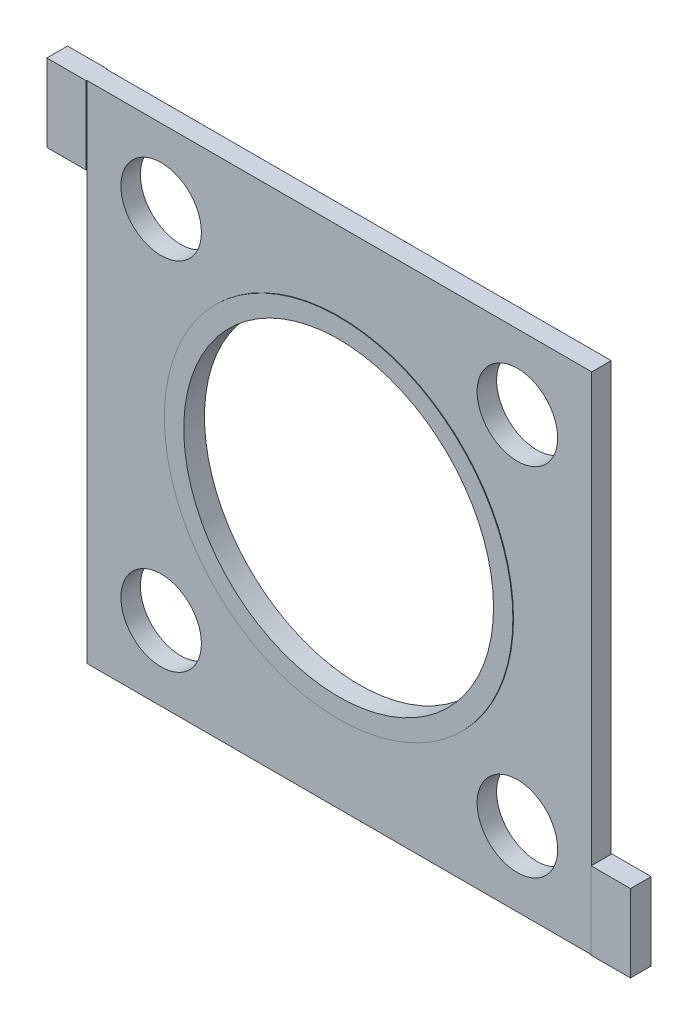
ISO-10303-21;
HEADER;
FILE_DESCRIPTION(('STEP AP214'),'2;1');
FILE_NAME('part.step','',(''),(''),'','','');
FILE_SCHEMA(('AUTOMOTIVE_DESIGN { 1 0 10303 214 1 1 1 1 }'));
ENDSEC;
DATA;
#1=APPLICATION_CONTEXT('core data for automotive mechanical design processes');
#2=APPLICATION_PROTOCOL_DEFINITION('international standard','automotive_design',2000,#1);
#3=PRODUCT_CONTEXT('',#1,'mechanical');
#4=PRODUCT('Part','Part','',(#3));
#5=PRODUCT_RELATED_PRODUCT_CATEGORY('part','',(#4));
#6=PRODUCT_DEFINITION_FORMATION('','',#4);
#7=PRODUCT_DEFINITION_CONTEXT('part definition',#1,'design');
#8=PRODUCT_DEFINITION('design','',#6,#7);
#9=PRODUCT_DEFINITION_SHAPE('','',#8);
#10=(LENGTH_UNIT() NAMED_UNIT(*) SI_UNIT(.MILLI.,.METRE.));
#11=(NAMED_UNIT(*) PLANE_ANGLE_UNIT() SI_UNIT($,.RADIAN.));
#12=(NAMED_UNIT(*) SI_UNIT($,.STERADIAN.) SOLID_ANGLE_UNIT());
#13=UNCERTAINTY_MEASURE_WITH_UNIT(LENGTH_MEASURE(1.E-05),#10,'distance_accuracy_value','');
#14=(GEOMETRIC_REPRESENTATION_CONTEXT(3) GLOBAL_UNCERTAINTY_ASSIGNED_CONTEXT((#13)) GLOBAL_UNIT_ASSIGNED_CONTEXT((#10,
#11,#12)) REPRESENTATION_CONTEXT('',''));
#15=CARTESIAN_POINT('',(0.,0.,0.));
#16=DIRECTION('',(0.,0.,1.));
#17=DIRECTION('',(1.,0.,0.));
#18=AXIS2_PLACEMENT_3D('',#15,#16,#17);
#19=CARTESIAN_POINT('',(0.,0.,0.79883));
#20=DIRECTION('',(0.,0.,1.));
#21=DIRECTION('',(1.,0.,0.));
#22=AXIS2_PLACEMENT_3D('',#19,#20,#21);
#23=PLANE('',#22);
#24=CARTESIAN_POINT('',(14.605,-14.605,0.79883));
#25=DIRECTION('',(0.,0.,-1.));
#26=DIRECTION('',(1.,0.,0.));
#27=AXIS2_PLACEMENT_3D('',#24,#25,#26);
#28=CIRCLE('',#27,3.30199999999999);
#29=CARTESIAN_POINT('',(17.907,-14.605,0.79883));
#30=VERTEX_POINT('',#29);
#31=EDGE_CURVE('E295',#30,#30,#28,.T.);
#32=ORIENTED_EDGE('',*,*,#31,.T.);
#33=EDGE_LOOP('',(#32));
#34=FACE_BOUND('',#33,.T.);
#35=CARTESIAN_POINT('',(-14.605,-14.605,0.79883));
#36=DIRECTION('',(0.,0.,-1.));
#37=DIRECTION('',(1.,0.,0.));
#38=AXIS2_PLACEMENT_3D('',#35,#36,#37);
#39=CIRCLE('',#38,3.302);
#40=CARTESIAN_POINT('',(-11.303,-14.605,0.79883));
#41=VERTEX_POINT('',#40);
#42=EDGE_CURVE('E285',#41,#41,#39,.T.);
#43=ORIENTED_EDGE('',*,*,#42,.T.);
#44=EDGE_LOOP('',(#43));
#45=FACE_BOUND('',#44,.T.);
#46=CARTESIAN_POINT('',(14.605,14.605,0.79883));
#47=DIRECTION('',(0.,0.,1.));
#48=DIRECTION('',(1.,0.,0.));
#49=AXIS2_PLACEMENT_3D('',#46,#47,#48);
#50=CIRCLE('',#49,3.30199999999999);
#51=CARTESIAN_POINT('',(17.907,14.605,0.79883));
#52=VERTEX_POINT('',#51);
#53=EDGE_CURVE('E282',#52,#52,#50,.T.);
#54=ORIENTED_EDGE('',*,*,#53,.F.);
#55=EDGE_LOOP('',(#54));
#56=FACE_BOUND('',#55,.T.);
#57=CARTESIAN_POINT('',(-14.605,14.605,0.79883));
#58=DIRECTION('',(0.,0.,1.));
#59=DIRECTION('',(1.,0.,0.));
#60=AXIS2_PLACEMENT_3D('',#57,#58,#59);
#61=CIRCLE('',#60,3.302);
#62=CARTESIAN_POINT('',(-11.303,14.605,0.79883));
#63=VERTEX_POINT('',#62);
#64=EDGE_CURVE('E279',#63,#63,#61,.T.);
#65=ORIENTED_EDGE('',*,*,#64,.F.);
#66=EDGE_LOOP('',(#65));
#67=FACE_BOUND('',#66,.T.);
#68=CARTESIAN_POINT('',(0.,0.,0.79883));
#69=DIRECTION('',(0.,0.,1.));
#70=DIRECTION('',(1.,0.,0.));
#71=AXIS2_PLACEMENT_3D('',#68,#69,#70);
#72=CIRCLE('',#71,14.2875);
#73=CARTESIAN_POINT('',(14.2875,0.,0.79883));
#74=VERTEX_POINT('',#73);
#75=EDGE_CURVE('E244',#74,#74,#72,.T.);
#76=ORIENTED_EDGE('',*,*,#75,.F.);
#77=EDGE_LOOP('',(#76));
#78=FACE_BOUND('',#77,.T.);
#79=DIRECTION('',(1.,0.,0.));
#80=VECTOR('',#79,1.);
#81=CARTESIAN_POINT('',(-20.701,-20.701,0.79883));
#82=LINE('',#81,#80);
#83=CARTESIAN_POINT('',(-20.701,-20.701,0.79883));
#84=VERTEX_POINT('',#83);
#85=CARTESIAN_POINT('',(20.701,-20.701,0.79883));
#86=VERTEX_POINT('',#85);
#87=EDGE_CURVE('E56',#84,#86,#82,.T.);
#88=ORIENTED_EDGE('',*,*,#87,.T.);
#89=DIRECTION('',(0.,-1.,0.));
#90=VECTOR('',#89,1.);
#91=CARTESIAN_POINT('',(20.701,-20.701,0.79883));
#92=LINE('',#91,#90);
#93=CARTESIAN_POINT('',(20.701,-14.351,0.79883));
#94=VERTEX_POINT('',#93);
#95=EDGE_CURVE('E206',#94,#86,#92,.T.);
#96=ORIENTED_EDGE('',*,*,#95,.F.);
#97=DIRECTION('',(0.,1.,0.));
#98=VECTOR('',#97,1.);
#99=CARTESIAN_POINT('',(20.701,20.701,0.79883));
#100=LINE('',#99,#98);
#101=CARTESIAN_POINT('',(20.701,20.701,0.79883));
#102=VERTEX_POINT('',#101);
#103=EDGE_CURVE('E263',#94,#102,#100,.T.);
#104=ORIENTED_EDGE('',*,*,#103,.T.);
#105=DIRECTION('',(-1.,0.,0.));
#106=VECTOR('',#105,1.);
#107=CARTESIAN_POINT('',(-20.701,20.701,0.79883));
#108=LINE('',#107,#106);
#109=CARTESIAN_POINT('',(-20.701,20.701,0.79883));
#110=VERTEX_POINT('',#109);
#111=EDGE_CURVE('E63',#102,#110,#108,.T.);
#112=ORIENTED_EDGE('',*,*,#111,.T.);
#113=DIRECTION('',(0.,1.,0.));
#114=VECTOR('',#113,1.);
#115=CARTESIAN_POINT('',(-20.701,20.701,0.79883));
#116=LINE('',#115,#114);
#117=CARTESIAN_POINT('',(-20.701,14.351,0.79883));
#118=VERTEX_POINT('',#117);
#119=EDGE_CURVE('E223',#118,#110,#116,.T.);
#120=ORIENTED_EDGE('',*,*,#119,.F.);
#121=DIRECTION('',(0.,-1.,0.));
#122=VECTOR('',#121,1.);
#123=CARTESIAN_POINT('',(-20.701,20.701,0.79883));
#124=LINE('',#123,#122);
#125=EDGE_CURVE('E257',#118,#84,#124,.T.);
#126=ORIENTED_EDGE('',*,*,#125,.T.);
#127=EDGE_LOOP('',(#88,#96,#104,#112,#120,#126));
#128=FACE_BOUND('',#127,.T.);
#129=ADVANCED_FACE('F39',(#34,#45,#56,#67,#78,#128),#23,.T.);
#130=CARTESIAN_POINT('',(-20.701,20.701,-0.79883));
#131=DIRECTION('',(-1.,0.,0.));
#132=DIRECTION('',(0.,0.,1.));
#133=AXIS2_PLACEMENT_3D('',#130,#131,#132);
#134=PLANE('',#133);
#135=DIRECTION('',(0.,0.,1.));
#136=VECTOR('',#135,1.);
#137=CARTESIAN_POINT('',(-20.701,14.351,-0.79883));
#138=LINE('',#137,#136);
#139=CARTESIAN_POINT('',(-20.701,14.351,-0.79883));
#140=VERTEX_POINT('',#139);
#141=EDGE_CURVE('E254',#140,#118,#138,.T.);
#142=ORIENTED_EDGE('',*,*,#141,.F.);
#143=DIRECTION('',(0.,-1.,0.));
#144=VECTOR('',#143,1.);
#145=CARTESIAN_POINT('',(-20.701,20.701,-0.79883));
#146=LINE('',#145,#144);
#147=CARTESIAN_POINT('',(-20.701,-20.701,-0.79883));
#148=VERTEX_POINT('',#147);
#149=EDGE_CURVE('E266',#140,#148,#146,.T.);
#150=ORIENTED_EDGE('',*,*,#149,.T.);
#151=DIRECTION('',(0.,0.,1.));
#152=VECTOR('',#151,1.);
#153=CARTESIAN_POINT('',(-20.701,-20.701,-0.79883));
#154=LINE('',#153,#152);
#155=EDGE_CURVE('E48',#148,#84,#154,.T.);
#156=ORIENTED_EDGE('',*,*,#155,.T.);
#157=ORIENTED_EDGE('',*,*,#125,.F.);
#158=EDGE_LOOP('',(#142,#150,#156,#157));
#159=FACE_BOUND('',#158,.T.);
#160=ADVANCED_FACE('F41',(#159),#134,.T.);
#161=CARTESIAN_POINT('',(-20.701,20.701,-0.79883));
#162=DIRECTION('',(0.,1.,0.));
#163=DIRECTION('',(0.,0.,1.));
#164=AXIS2_PLACEMENT_3D('',#161,#162,#163);
#165=PLANE('',#164);
#166=DIRECTION('',(-1.,0.,0.));
#167=VECTOR('',#166,1.);
#168=CARTESIAN_POINT('',(-20.701,20.701,-0.79883));
#169=LINE('',#168,#167);
#170=CARTESIAN_POINT('',(20.701,20.701,-0.79883));
#171=VERTEX_POINT('',#170);
#172=CARTESIAN_POINT('',(-20.701,20.701,-0.79883));
#173=VERTEX_POINT('',#172);
#174=EDGE_CURVE('E272',#171,#173,#169,.T.);
#175=ORIENTED_EDGE('',*,*,#174,.T.);
#176=DIRECTION('',(0.,0.,1.));
#177=VECTOR('',#176,1.);
#178=CARTESIAN_POINT('',(-20.701,20.701,-0.84963));
#179=LINE('',#178,#177);
#180=CARTESIAN_POINT('',(-20.701,20.701,-0.84963));
#181=VERTEX_POINT('',#180);
#182=EDGE_CURVE('E197',#181,#173,#179,.T.);
#183=ORIENTED_EDGE('',*,*,#182,.F.);
#184=DIRECTION('',(-1.,0.,0.));
#185=VECTOR('',#184,1.);
#186=CARTESIAN_POINT('',(-23.92934,20.701,-0.84963));
#187=LINE('',#186,#185);
#188=CARTESIAN_POINT('',(-23.92934,20.701,-0.84963));
#189=VERTEX_POINT('',#188);
#190=EDGE_CURVE('E184',#181,#189,#187,.T.);
#191=ORIENTED_EDGE('',*,*,#190,.T.);
#192=DIRECTION('',(0.,0.,1.));
#193=VECTOR('',#192,1.);
#194=CARTESIAN_POINT('',(-23.92934,20.701,-0.79883));
#195=LINE('',#194,#193);
#196=CARTESIAN_POINT('',(-23.92934,20.701,0.84963));
#197=VERTEX_POINT('',#196);
#198=EDGE_CURVE('E252',#189,#197,#195,.T.);
#199=ORIENTED_EDGE('',*,*,#198,.T.);
#200=DIRECTION('',(-1.,0.,0.));
#201=VECTOR('',#200,1.);
#202=CARTESIAN_POINT('',(-23.92934,20.701,0.84963));
#203=LINE('',#202,#201);
#204=CARTESIAN_POINT('',(-20.701,20.701,0.84963));
#205=VERTEX_POINT('',#204);
#206=EDGE_CURVE('E231',#205,#197,#203,.T.);
#207=ORIENTED_EDGE('',*,*,#206,.F.);
#208=DIRECTION('',(0.,0.,-1.));
#209=VECTOR('',#208,1.);
#210=CARTESIAN_POINT('',(-20.701,20.701,0.84963));
#211=LINE('',#210,#209);
#212=EDGE_CURVE('E234',#205,#110,#211,.T.);
#213=ORIENTED_EDGE('',*,*,#212,.T.);
#214=ORIENTED_EDGE('',*,*,#111,.F.);
#215=DIRECTION('',(0.,0.,1.));
#216=VECTOR('',#215,1.);
#217=CARTESIAN_POINT('',(20.701,20.701,-0.79883));
#218=LINE('',#217,#216);
#219=EDGE_CURVE('E11',#171,#102,#218,.T.);
#220=ORIENTED_EDGE('',*,*,#219,.F.);
#221=EDGE_LOOP('',(#175,#183,#191,#199,#207,#213,#214,#220));
#222=FACE_BOUND('',#221,.T.);
#223=ADVANCED_FACE('F348',(#222),#165,.T.);
#224=CARTESIAN_POINT('',(20.701,20.701,-0.79883));
#225=DIRECTION('',(1.,0.,0.));
#226=DIRECTION('',(0.,1.,0.));
#227=AXIS2_PLACEMENT_3D('',#224,#225,#226);
#228=PLANE('',#227);
#229=DIRECTION('',(0.,0.,1.));
#230=VECTOR('',#229,1.);
#231=CARTESIAN_POINT('',(20.701,-14.351,-0.79883));
#232=LINE('',#231,#230);
#233=CARTESIAN_POINT('',(20.701,-14.351,-0.79883));
#234=VERTEX_POINT('',#233);
#235=EDGE_CURVE('E249',#234,#94,#232,.T.);
#236=ORIENTED_EDGE('',*,*,#235,.F.);
#237=DIRECTION('',(0.,1.,0.));
#238=VECTOR('',#237,1.);
#239=CARTESIAN_POINT('',(20.701,20.701,-0.79883));
#240=LINE('',#239,#238);
#241=EDGE_CURVE('E270',#234,#171,#240,.T.);
#242=ORIENTED_EDGE('',*,*,#241,.T.);
#243=ORIENTED_EDGE('',*,*,#219,.T.);
#244=ORIENTED_EDGE('',*,*,#103,.F.);
#245=EDGE_LOOP('',(#236,#242,#243,#244));
#246=FACE_BOUND('',#245,.T.);
#247=ADVANCED_FACE('F351',(#246),#228,.T.);
#248=CARTESIAN_POINT('',(-20.701,-20.701,-0.79883));
#249=DIRECTION('',(0.,-1.,0.));
#250=DIRECTION('',(0.,0.,-1.));
#251=AXIS2_PLACEMENT_3D('',#248,#249,#250);
#252=PLANE('',#251);
#253=DIRECTION('',(1.,0.,0.));
#254=VECTOR('',#253,1.);
#255=CARTESIAN_POINT('',(-20.701,-20.701,-0.79883));
#256=LINE('',#255,#254);
#257=CARTESIAN_POINT('',(20.701,-20.701,-0.79883));
#258=VERTEX_POINT('',#257);
#259=EDGE_CURVE('E268',#148,#258,#256,.T.);
#260=ORIENTED_EDGE('',*,*,#259,.T.);
#261=DIRECTION('',(0.,0.,1.));
#262=VECTOR('',#261,1.);
#263=CARTESIAN_POINT('',(20.701,-20.701,-0.84963));
#264=LINE('',#263,#262);
#265=CARTESIAN_POINT('',(20.701,-20.701,-0.84963));
#266=VERTEX_POINT('',#265);
#267=EDGE_CURVE('E167',#266,#258,#264,.T.);
#268=ORIENTED_EDGE('',*,*,#267,.F.);
#269=DIRECTION('',(1.,0.,0.));
#270=VECTOR('',#269,1.);
#271=CARTESIAN_POINT('',(23.92934,-20.701,-0.84963));
#272=LINE('',#271,#270);
#273=CARTESIAN_POINT('',(23.92934,-20.701,-0.84963));
#274=VERTEX_POINT('',#273);
#275=EDGE_CURVE('E159',#266,#274,#272,.T.);
#276=ORIENTED_EDGE('',*,*,#275,.T.);
#277=DIRECTION('',(0.,0.,1.));
#278=VECTOR('',#277,1.);
#279=CARTESIAN_POINT('',(23.92934,-20.701,-0.79883));
#280=LINE('',#279,#278);
#281=CARTESIAN_POINT('',(23.92934,-20.701,0.84963));
#282=VERTEX_POINT('',#281);
#283=EDGE_CURVE('E141',#274,#282,#280,.T.);
#284=ORIENTED_EDGE('',*,*,#283,.T.);
#285=DIRECTION('',(1.,0.,0.));
#286=VECTOR('',#285,1.);
#287=CARTESIAN_POINT('',(23.92934,-20.701,0.84963));
#288=LINE('',#287,#286);
#289=CARTESIAN_POINT('',(20.701,-20.701,0.84963));
#290=VERTEX_POINT('',#289);
#291=EDGE_CURVE('E214',#290,#282,#288,.T.);
#292=ORIENTED_EDGE('',*,*,#291,.F.);
#293=DIRECTION('',(0.,0.,-1.));
#294=VECTOR('',#293,1.);
#295=CARTESIAN_POINT('',(20.701,-20.701,0.84963));
#296=LINE('',#295,#294);
#297=EDGE_CURVE('E216',#290,#86,#296,.T.);
#298=ORIENTED_EDGE('',*,*,#297,.T.);
#299=ORIENTED_EDGE('',*,*,#87,.F.);
#300=ORIENTED_EDGE('',*,*,#155,.F.);
#301=EDGE_LOOP('',(#260,#268,#276,#284,#292,#298,#299,#300));
#302=FACE_BOUND('',#301,.T.);
#303=ADVANCED_FACE('F166',(#302),#252,.T.);
#304=CARTESIAN_POINT('',(0.,0.,-0.79883));
#305=DIRECTION('',(0.,0.,1.));
#306=DIRECTION('',(1.,0.,0.));
#307=AXIS2_PLACEMENT_3D('',#304,#305,#306);
#308=PLANE('',#307);
#309=CARTESIAN_POINT('',(14.605,-14.605,-0.79883));
#310=DIRECTION('',(0.,0.,1.));
#311=DIRECTION('',(1.,0.,0.));
#312=AXIS2_PLACEMENT_3D('',#309,#310,#311);
#313=CIRCLE('',#312,3.30199999999999);
#314=CARTESIAN_POINT('',(17.907,-14.605,-0.79883));
#315=VERTEX_POINT('',#314);
#316=EDGE_CURVE('E43',#315,#315,#313,.F.);
#317=ORIENTED_EDGE('',*,*,#316,.F.);
#318=EDGE_LOOP('',(#317));
#319=FACE_BOUND('',#318,.T.);
#320=CARTESIAN_POINT('',(-14.605,-14.605,-0.79883));
#321=DIRECTION('',(0.,0.,1.));
#322=DIRECTION('',(1.,0.,0.));
#323=AXIS2_PLACEMENT_3D('',#320,#321,#322);
#324=CIRCLE('',#323,3.302);
#325=CARTESIAN_POINT('',(-11.303,-14.605,-0.79883));
#326=VERTEX_POINT('',#325);
#327=EDGE_CURVE('E283',#326,#326,#324,.F.);
#328=ORIENTED_EDGE('',*,*,#327,.F.);
#329=EDGE_LOOP('',(#328));
#330=FACE_BOUND('',#329,.T.);
#331=CARTESIAN_POINT('',(14.605,14.605,-0.79883));
#332=DIRECTION('',(0.,0.,1.));
#333=DIRECTION('',(1.,0.,0.));
#334=AXIS2_PLACEMENT_3D('',#331,#332,#333);
#335=CIRCLE('',#334,3.30199999999999);
#336=CARTESIAN_POINT('',(17.907,14.605,-0.79883));
#337=VERTEX_POINT('',#336);
#338=EDGE_CURVE('E280',#337,#337,#335,.T.);
#339=ORIENTED_EDGE('',*,*,#338,.T.);
#340=EDGE_LOOP('',(#339));
#341=FACE_BOUND('',#340,.T.);
#342=CARTESIAN_POINT('',(-14.605,14.605,-0.79883));
#343=DIRECTION('',(0.,0.,1.));
#344=DIRECTION('',(1.,0.,0.));
#345=AXIS2_PLACEMENT_3D('',#342,#343,#344);
#346=CIRCLE('',#345,3.302);
#347=CARTESIAN_POINT('',(-11.303,14.605,-0.79883));
#348=VERTEX_POINT('',#347);
#349=EDGE_CURVE('E177',#348,#348,#346,.T.);
#350=ORIENTED_EDGE('',*,*,#349,.T.);
#351=EDGE_LOOP('',(#350));
#352=FACE_BOUND('',#351,.T.);
#353=CARTESIAN_POINT('',(0.,0.,-0.79883));
#354=DIRECTION('',(0.,0.,1.));
#355=DIRECTION('',(1.,0.,0.));
#356=AXIS2_PLACEMENT_3D('',#353,#354,#355);
#357=CIRCLE('',#356,14.2875);
#358=CARTESIAN_POINT('',(14.2875,0.,-0.79883));
#359=VERTEX_POINT('',#358);
#360=EDGE_CURVE('E202',#359,#359,#357,.T.);
#361=ORIENTED_EDGE('',*,*,#360,.T.);
#362=EDGE_LOOP('',(#361));
#363=FACE_BOUND('',#362,.T.);
#364=ORIENTED_EDGE('',*,*,#241,.F.);
#365=DIRECTION('',(0.,-1.,0.));
#366=VECTOR('',#365,1.);
#367=CARTESIAN_POINT('',(20.701,-20.701,-0.79883));
#368=LINE('',#367,#366);
#369=EDGE_CURVE('E163',#234,#258,#368,.T.);
#370=ORIENTED_EDGE('',*,*,#369,.T.);
#371=ORIENTED_EDGE('',*,*,#259,.F.);
#372=ORIENTED_EDGE('',*,*,#149,.F.);
#373=DIRECTION('',(0.,1.,0.));
#374=VECTOR('',#373,1.);
#375=CARTESIAN_POINT('',(-20.701,20.701,-0.79883));
#376=LINE('',#375,#374);
#377=EDGE_CURVE('E180',#140,#173,#376,.T.);
#378=ORIENTED_EDGE('',*,*,#377,.T.);
#379=ORIENTED_EDGE('',*,*,#174,.F.);
#380=EDGE_LOOP('',(#364,#370,#371,#372,#378,#379));
#381=FACE_BOUND('',#380,.T.);
#382=ADVANCED_FACE('F340',(#319,#330,#341,#352,#363,#381),#308,.F.);
#383=CARTESIAN_POINT('',(-20.701,14.351,-0.79883));
#384=DIRECTION('',(0.,-1.,0.));
#385=DIRECTION('',(0.,0.,-1.));
#386=AXIS2_PLACEMENT_3D('',#383,#384,#385);
#387=PLANE('',#386);
#388=ORIENTED_EDGE('',*,*,#141,.T.);
#389=DIRECTION('',(0.,0.,-1.));
#390=VECTOR('',#389,1.);
#391=CARTESIAN_POINT('',(-20.701,14.351,0.84963));
#392=LINE('',#391,#390);
#393=CARTESIAN_POINT('',(-20.701,14.351,0.84963));
#394=VERTEX_POINT('',#393);
#395=EDGE_CURVE('E238',#394,#118,#392,.T.);
#396=ORIENTED_EDGE('',*,*,#395,.F.);
#397=DIRECTION('',(1.,0.,0.));
#398=VECTOR('',#397,1.);
#399=CARTESIAN_POINT('',(-23.92934,14.351,0.84963));
#400=LINE('',#399,#398);
#401=CARTESIAN_POINT('',(-23.92934,14.351,0.84963));
#402=VERTEX_POINT('',#401);
#403=EDGE_CURVE('E227',#402,#394,#400,.T.);
#404=ORIENTED_EDGE('',*,*,#403,.F.);
#405=DIRECTION('',(0.,0.,1.));
#406=VECTOR('',#405,1.);
#407=CARTESIAN_POINT('',(-23.92934,14.351,-0.79883));
#408=LINE('',#407,#406);
#409=CARTESIAN_POINT('',(-23.92934,14.351,-0.84963));
#410=VERTEX_POINT('',#409);
#411=EDGE_CURVE('E258',#410,#402,#408,.T.);
#412=ORIENTED_EDGE('',*,*,#411,.F.);
#413=DIRECTION('',(1.,0.,0.));
#414=VECTOR('',#413,1.);
#415=CARTESIAN_POINT('',(-23.92934,14.351,-0.84963));
#416=LINE('',#415,#414);
#417=CARTESIAN_POINT('',(-20.701,14.351,-0.84963));
#418=VERTEX_POINT('',#417);
#419=EDGE_CURVE('E190',#410,#418,#416,.T.);
#420=ORIENTED_EDGE('',*,*,#419,.T.);
#421=DIRECTION('',(0.,0.,1.));
#422=VECTOR('',#421,1.);
#423=CARTESIAN_POINT('',(-20.701,14.351,-0.84963));
#424=LINE('',#423,#422);
#425=EDGE_CURVE('E193',#418,#140,#424,.T.);
#426=ORIENTED_EDGE('',*,*,#425,.T.);
#427=EDGE_LOOP('',(#388,#396,#404,#412,#420,#426));
#428=FACE_BOUND('',#427,.T.);
#429=ADVANCED_FACE('F337',(#428),#387,.T.);
#430=CARTESIAN_POINT('',(-23.92934,20.701,-0.79883));
#431=DIRECTION('',(-1.,0.,0.));
#432=DIRECTION('',(0.,0.,1.));
#433=AXIS2_PLACEMENT_3D('',#430,#431,#432);
#434=PLANE('',#433);
#435=ORIENTED_EDGE('',*,*,#411,.T.);
#436=DIRECTION('',(0.,-1.,0.));
#437=VECTOR('',#436,1.);
#438=CARTESIAN_POINT('',(-23.92934,20.701,0.84963));
#439=LINE('',#438,#437);
#440=EDGE_CURVE('E224',#197,#402,#439,.T.);
#441=ORIENTED_EDGE('',*,*,#440,.F.);
#442=ORIENTED_EDGE('',*,*,#198,.F.);
#443=DIRECTION('',(0.,-1.,0.));
#444=VECTOR('',#443,1.);
#445=CARTESIAN_POINT('',(-23.92934,20.701,-0.84963));
#446=LINE('',#445,#444);
#447=EDGE_CURVE('E181',#189,#410,#446,.T.);
#448=ORIENTED_EDGE('',*,*,#447,.T.);
#449=EDGE_LOOP('',(#435,#441,#442,#448));
#450=FACE_BOUND('',#449,.T.);
#451=ADVANCED_FACE('F333',(#450),#434,.T.);
#452=CARTESIAN_POINT('',(20.701,-14.351,-0.79883));
#453=DIRECTION('',(0.,1.,0.));
#454=DIRECTION('',(0.,0.,1.));
#455=AXIS2_PLACEMENT_3D('',#452,#453,#454);
#456=PLANE('',#455);
#457=ORIENTED_EDGE('',*,*,#235,.T.);
#458=DIRECTION('',(0.,0.,-1.));
#459=VECTOR('',#458,1.);
#460=CARTESIAN_POINT('',(20.701,-14.351,0.84963));
#461=LINE('',#460,#459);
#462=CARTESIAN_POINT('',(20.701,-14.351,0.84963));
#463=VERTEX_POINT('',#462);
#464=EDGE_CURVE('E220',#463,#94,#461,.T.);
#465=ORIENTED_EDGE('',*,*,#464,.F.);
#466=DIRECTION('',(-1.,0.,0.));
#467=VECTOR('',#466,1.);
#468=CARTESIAN_POINT('',(23.92934,-14.351,0.84963));
#469=LINE('',#468,#467);
#470=CARTESIAN_POINT('',(23.92934,-14.351,0.84963));
#471=VERTEX_POINT('',#470);
#472=EDGE_CURVE('E210',#471,#463,#469,.T.);
#473=ORIENTED_EDGE('',*,*,#472,.F.);
#474=DIRECTION('',(0.,0.,1.));
#475=VECTOR('',#474,1.);
#476=CARTESIAN_POINT('',(23.92934,-14.351,-0.79883));
#477=LINE('',#476,#475);
#478=CARTESIAN_POINT('',(23.92934,-14.351,-0.84963));
#479=VERTEX_POINT('',#478);
#480=EDGE_CURVE('E152',#479,#471,#477,.T.);
#481=ORIENTED_EDGE('',*,*,#480,.F.);
#482=DIRECTION('',(-1.,0.,0.));
#483=VECTOR('',#482,1.);
#484=CARTESIAN_POINT('',(23.92934,-14.351,-0.84963));
#485=LINE('',#484,#483);
#486=CARTESIAN_POINT('',(20.701,-14.351,-0.84963));
#487=VERTEX_POINT('',#486);
#488=EDGE_CURVE('E162',#479,#487,#485,.T.);
#489=ORIENTED_EDGE('',*,*,#488,.T.);
#490=DIRECTION('',(0.,0.,1.));
#491=VECTOR('',#490,1.);
#492=CARTESIAN_POINT('',(20.701,-14.351,-0.84963));
#493=LINE('',#492,#491);
#494=EDGE_CURVE('E174',#487,#234,#493,.T.);
#495=ORIENTED_EDGE('',*,*,#494,.T.);
#496=EDGE_LOOP('',(#457,#465,#473,#481,#489,#495));
#497=FACE_BOUND('',#496,.T.);
#498=ADVANCED_FACE('F330',(#497),#456,.T.);
#499=CARTESIAN_POINT('',(23.92934,-20.701,-0.79883));
#500=DIRECTION('',(1.,0.,0.));
#501=DIRECTION('',(0.,0.,-1.));
#502=AXIS2_PLACEMENT_3D('',#499,#500,#501);
#503=PLANE('',#502);
#504=ORIENTED_EDGE('',*,*,#480,.T.);
#505=DIRECTION('',(0.,1.,0.));
#506=VECTOR('',#505,1.);
#507=CARTESIAN_POINT('',(23.92934,-20.701,0.84963));
#508=LINE('',#507,#506);
#509=EDGE_CURVE('E147',#282,#471,#508,.T.);
#510=ORIENTED_EDGE('',*,*,#509,.F.);
#511=ORIENTED_EDGE('',*,*,#283,.F.);
#512=DIRECTION('',(0.,1.,0.));
#513=VECTOR('',#512,1.);
#514=CARTESIAN_POINT('',(23.92934,-20.701,-0.84963));
#515=LINE('',#514,#513);
#516=EDGE_CURVE('E144',#274,#479,#515,.T.);
#517=ORIENTED_EDGE('',*,*,#516,.T.);
#518=EDGE_LOOP('',(#504,#510,#511,#517));
#519=FACE_BOUND('',#518,.T.);
#520=ADVANCED_FACE('F143',(#519),#503,.T.);
#521=CARTESIAN_POINT('',(0.,0.,-0.79883));
#522=DIRECTION('',(0.,0.,1.));
#523=DIRECTION('',(1.,0.,0.));
#524=AXIS2_PLACEMENT_3D('',#521,#522,#523);
#525=CYLINDRICAL_SURFACE('',#524,12.7);
#526=CARTESIAN_POINT('',(0.,0.,0.84963));
#527=DIRECTION('',(0.,0.,1.));
#528=DIRECTION('',(1.,0.,0.));
#529=AXIS2_PLACEMENT_3D('',#526,#527,#528);
#530=CIRCLE('',#529,12.7);
#531=CARTESIAN_POINT('',(12.7,0.,0.84963));
#532=VERTEX_POINT('',#531);
#533=EDGE_CURVE('E241',#532,#532,#530,.T.);
#534=ORIENTED_EDGE('',*,*,#533,.T.);
#535=EDGE_LOOP('',(#534));
#536=FACE_BOUND('',#535,.T.);
#537=CARTESIAN_POINT('',(0.,0.,-0.84963));
#538=DIRECTION('',(0.,0.,1.));
#539=DIRECTION('',(1.,0.,0.));
#540=AXIS2_PLACEMENT_3D('',#537,#538,#539);
#541=CIRCLE('',#540,12.7);
#542=CARTESIAN_POINT('',(12.7,0.,-0.84963));
#543=VERTEX_POINT('',#542);
#544=EDGE_CURVE('E199',#543,#543,#541,.T.);
#545=ORIENTED_EDGE('',*,*,#544,.F.);
#546=EDGE_LOOP('',(#545));
#547=FACE_BOUND('',#546,.T.);
#548=ADVANCED_FACE('F322',(#536,#547),#525,.F.);
#549=CARTESIAN_POINT('',(0.,0.,0.84963));
#550=DIRECTION('',(0.,0.,1.));
#551=DIRECTION('',(1.,0.,0.));
#552=AXIS2_PLACEMENT_3D('',#549,#550,#551);
#553=PLANE('',#552);
#554=CARTESIAN_POINT('',(0.,0.,0.84963));
#555=DIRECTION('',(0.,0.,1.));
#556=DIRECTION('',(1.,0.,0.));
#557=AXIS2_PLACEMENT_3D('',#554,#555,#556);
#558=CIRCLE('',#557,14.2875);
#559=CARTESIAN_POINT('',(14.2875,0.,0.84963));
#560=VERTEX_POINT('',#559);
#561=EDGE_CURVE('E153',#560,#560,#558,.T.);
#562=ORIENTED_EDGE('',*,*,#561,.T.);
#563=EDGE_LOOP('',(#562));
#564=FACE_BOUND('',#563,.T.);
#565=ORIENTED_EDGE('',*,*,#533,.F.);
#566=EDGE_LOOP('',(#565));
#567=FACE_BOUND('',#566,.T.);
#568=ADVANCED_FACE('F312',(#564,#567),#553,.T.);
#569=CARTESIAN_POINT('',(0.,0.,0.84963));
#570=DIRECTION('',(0.,0.,-1.));
#571=DIRECTION('',(-1.,0.,0.));
#572=AXIS2_PLACEMENT_3D('',#569,#570,#571);
#573=CYLINDRICAL_SURFACE('',#572,14.2875);
#574=ORIENTED_EDGE('',*,*,#561,.F.);
#575=EDGE_LOOP('',(#574));
#576=FACE_BOUND('',#575,.T.);
#577=ORIENTED_EDGE('',*,*,#75,.T.);
#578=EDGE_LOOP('',(#577));
#579=FACE_BOUND('',#578,.T.);
#580=ADVANCED_FACE('F309',(#576,#579),#573,.T.);
#581=CARTESIAN_POINT('',(-20.701,20.701,0.84963));
#582=DIRECTION('',(-1.,0.,0.));
#583=DIRECTION('',(0.,0.,1.));
#584=AXIS2_PLACEMENT_3D('',#581,#582,#583);
#585=PLANE('',#584);
#586=ORIENTED_EDGE('',*,*,#119,.T.);
#587=ORIENTED_EDGE('',*,*,#212,.F.);
#588=DIRECTION('',(0.,1.,0.));
#589=VECTOR('',#588,1.);
#590=CARTESIAN_POINT('',(-20.701,20.701,0.84963));
#591=LINE('',#590,#589);
#592=EDGE_CURVE('E229',#394,#205,#591,.T.);
#593=ORIENTED_EDGE('',*,*,#592,.F.);
#594=ORIENTED_EDGE('',*,*,#395,.T.);
#595=EDGE_LOOP('',(#586,#587,#593,#594));
#596=FACE_BOUND('',#595,.T.);
#597=ADVANCED_FACE('F311',(#596),#585,.F.);
#598=CARTESIAN_POINT('',(0.,0.,0.84963));
#599=DIRECTION('',(0.,0.,1.));
#600=DIRECTION('',(1.,0.,0.));
#601=AXIS2_PLACEMENT_3D('',#598,#599,#600);
#602=PLANE('',#601);
#603=ORIENTED_EDGE('',*,*,#440,.T.);
#604=ORIENTED_EDGE('',*,*,#403,.T.);
#605=ORIENTED_EDGE('',*,*,#592,.T.);
#606=ORIENTED_EDGE('',*,*,#206,.T.);
#607=EDGE_LOOP('',(#603,#604,#605,#606));
#608=FACE_BOUND('',#607,.T.);
#609=ADVANCED_FACE('F319',(#608),#602,.T.);
#610=CARTESIAN_POINT('',(20.701,-20.701,0.84963));
#611=DIRECTION('',(1.,0.,0.));
#612=DIRECTION('',(0.,0.,-1.));
#613=AXIS2_PLACEMENT_3D('',#610,#611,#612);
#614=PLANE('',#613);
#615=ORIENTED_EDGE('',*,*,#95,.T.);
#616=ORIENTED_EDGE('',*,*,#297,.F.);
#617=DIRECTION('',(0.,-1.,0.));
#618=VECTOR('',#617,1.);
#619=CARTESIAN_POINT('',(20.701,-20.701,0.84963));
#620=LINE('',#619,#618);
#621=EDGE_CURVE('E212',#463,#290,#620,.T.);
#622=ORIENTED_EDGE('',*,*,#621,.F.);
#623=ORIENTED_EDGE('',*,*,#464,.T.);
#624=EDGE_LOOP('',(#615,#616,#622,#623));
#625=FACE_BOUND('',#624,.T.);
#626=ADVANCED_FACE('F416',(#625),#614,.F.);
#627=CARTESIAN_POINT('',(0.,0.,0.84963));
#628=DIRECTION('',(0.,0.,1.));
#629=DIRECTION('',(1.,0.,0.));
#630=AXIS2_PLACEMENT_3D('',#627,#628,#629);
#631=PLANE('',#630);
#632=ORIENTED_EDGE('',*,*,#509,.T.);
#633=ORIENTED_EDGE('',*,*,#472,.T.);
#634=ORIENTED_EDGE('',*,*,#621,.T.);
#635=ORIENTED_EDGE('',*,*,#291,.T.);
#636=EDGE_LOOP('',(#632,#633,#634,#635));
#637=FACE_BOUND('',#636,.T.);
#638=ADVANCED_FACE('F426',(#637),#631,.T.);
#639=CARTESIAN_POINT('',(0.,0.,-0.84963));
#640=DIRECTION('',(0.,0.,1.));
#641=DIRECTION('',(1.,0.,0.));
#642=AXIS2_PLACEMENT_3D('',#639,#640,#641);
#643=CYLINDRICAL_SURFACE('',#642,14.2875);
#644=CARTESIAN_POINT('',(0.,0.,-0.84963));
#645=DIRECTION('',(0.,0.,1.));
#646=DIRECTION('',(1.,0.,0.));
#647=AXIS2_PLACEMENT_3D('',#644,#645,#646);
#648=CIRCLE('',#647,14.2875);
#649=CARTESIAN_POINT('',(14.2875,0.,-0.84963));
#650=VERTEX_POINT('',#649);
#651=EDGE_CURVE('E203',#650,#650,#648,.T.);
#652=ORIENTED_EDGE('',*,*,#651,.T.);
#653=EDGE_LOOP('',(#652));
#654=FACE_BOUND('',#653,.T.);
#655=ORIENTED_EDGE('',*,*,#360,.F.);
#656=EDGE_LOOP('',(#655));
#657=FACE_BOUND('',#656,.T.);
#658=ADVANCED_FACE('F436',(#654,#657),#643,.T.);
#659=CARTESIAN_POINT('',(0.,0.,-0.84963));
#660=DIRECTION('',(0.,0.,-1.));
#661=DIRECTION('',(1.,0.,0.));
#662=AXIS2_PLACEMENT_3D('',#659,#660,#661);
#663=PLANE('',#662);
#664=ORIENTED_EDGE('',*,*,#544,.T.);
#665=EDGE_LOOP('',(#664));
#666=FACE_BOUND('',#665,.T.);
#667=ORIENTED_EDGE('',*,*,#651,.F.);
#668=EDGE_LOOP('',(#667));
#669=FACE_BOUND('',#668,.T.);
#670=ADVANCED_FACE('F530',(#666,#669),#663,.T.);
#671=CARTESIAN_POINT('',(-20.701,20.701,-0.84963));
#672=DIRECTION('',(1.,0.,0.));
#673=DIRECTION('',(0.,0.,-1.));
#674=AXIS2_PLACEMENT_3D('',#671,#672,#673);
#675=PLANE('',#674);
#676=ORIENTED_EDGE('',*,*,#377,.F.);
#677=ORIENTED_EDGE('',*,*,#425,.F.);
#678=DIRECTION('',(0.,1.,0.));
#679=VECTOR('',#678,1.);
#680=CARTESIAN_POINT('',(-20.701,20.701,-0.84963));
#681=LINE('',#680,#679);
#682=EDGE_CURVE('E187',#418,#181,#681,.T.);
#683=ORIENTED_EDGE('',*,*,#682,.T.);
#684=ORIENTED_EDGE('',*,*,#182,.T.);
#685=EDGE_LOOP('',(#676,#677,#683,#684));
#686=FACE_BOUND('',#685,.T.);
#687=ADVANCED_FACE('F523',(#686),#675,.T.);
#688=CARTESIAN_POINT('',(0.,0.,-0.84963));
#689=DIRECTION('',(0.,0.,-1.));
#690=DIRECTION('',(1.,0.,0.));
#691=AXIS2_PLACEMENT_3D('',#688,#689,#690);
#692=PLANE('',#691);
#693=ORIENTED_EDGE('',*,*,#447,.F.);
#694=ORIENTED_EDGE('',*,*,#190,.F.);
#695=ORIENTED_EDGE('',*,*,#682,.F.);
#696=ORIENTED_EDGE('',*,*,#419,.F.);
#697=EDGE_LOOP('',(#693,#694,#695,#696));
#698=FACE_BOUND('',#697,.T.);
#699=ADVANCED_FACE('F529',(#698),#692,.T.);
#700=CARTESIAN_POINT('',(20.701,-20.701,-0.84963));
#701=DIRECTION('',(-1.,0.,0.));
#702=DIRECTION('',(0.,0.,1.));
#703=AXIS2_PLACEMENT_3D('',#700,#701,#702);
#704=PLANE('',#703);
#705=ORIENTED_EDGE('',*,*,#369,.F.);
#706=ORIENTED_EDGE('',*,*,#494,.F.);
#707=DIRECTION('',(0.,-1.,0.));
#708=VECTOR('',#707,1.);
#709=CARTESIAN_POINT('',(20.701,-20.701,-0.84963));
#710=LINE('',#709,#708);
#711=EDGE_CURVE('E168',#487,#266,#710,.T.);
#712=ORIENTED_EDGE('',*,*,#711,.T.);
#713=ORIENTED_EDGE('',*,*,#267,.T.);
#714=EDGE_LOOP('',(#705,#706,#712,#713));
#715=FACE_BOUND('',#714,.T.);
#716=ADVANCED_FACE('F541',(#715),#704,.T.);
#717=CARTESIAN_POINT('',(0.,0.,-0.84963));
#718=DIRECTION('',(0.,0.,-1.));
#719=DIRECTION('',(1.,0.,0.));
#720=AXIS2_PLACEMENT_3D('',#717,#718,#719);
#721=PLANE('',#720);
#722=ORIENTED_EDGE('',*,*,#516,.F.);
#723=ORIENTED_EDGE('',*,*,#275,.F.);
#724=ORIENTED_EDGE('',*,*,#711,.F.);
#725=ORIENTED_EDGE('',*,*,#488,.F.);
#726=EDGE_LOOP('',(#722,#723,#724,#725));
#727=FACE_BOUND('',#726,.T.);
#728=ADVANCED_FACE('F157',(#727),#721,.T.);
#729=CARTESIAN_POINT('',(-14.605,14.605,-0.84963));
#730=DIRECTION('',(0.,0.,1.));
#731=DIRECTION('',(1.,0.,0.));
#732=AXIS2_PLACEMENT_3D('',#729,#730,#731);
#733=CYLINDRICAL_SURFACE('',#732,3.302);
#734=ORIENTED_EDGE('',*,*,#64,.T.);
#735=EDGE_LOOP('',(#734));
#736=FACE_BOUND('',#735,.T.);
#737=ORIENTED_EDGE('',*,*,#349,.F.);
#738=EDGE_LOOP('',(#737));
#739=FACE_BOUND('',#738,.T.);
#740=ADVANCED_FACE('F300',(#736,#739),#733,.F.);
#741=CARTESIAN_POINT('',(14.605,14.605,-0.84963));
#742=DIRECTION('',(0.,0.,1.));
#743=DIRECTION('',(1.,0.,0.));
#744=AXIS2_PLACEMENT_3D('',#741,#742,#743);
#745=CYLINDRICAL_SURFACE('',#744,3.30199999999999);
#746=ORIENTED_EDGE('',*,*,#53,.T.);
#747=EDGE_LOOP('',(#746));
#748=FACE_BOUND('',#747,.T.);
#749=ORIENTED_EDGE('',*,*,#338,.F.);
#750=EDGE_LOOP('',(#749));
#751=FACE_BOUND('',#750,.T.);
#752=ADVANCED_FACE('F568',(#748,#751),#745,.F.);
#753=CARTESIAN_POINT('',(-14.605,-14.605,-0.84963));
#754=DIRECTION('',(0.,0.,1.));
#755=DIRECTION('',(1.,0.,0.));
#756=AXIS2_PLACEMENT_3D('',#753,#754,#755);
#757=CYLINDRICAL_SURFACE('',#756,3.302);
#758=ORIENTED_EDGE('',*,*,#42,.F.);
#759=EDGE_LOOP('',(#758));
#760=FACE_BOUND('',#759,.T.);
#761=ORIENTED_EDGE('',*,*,#327,.T.);
#762=EDGE_LOOP('',(#761));
#763=FACE_BOUND('',#762,.T.);
#764=ADVANCED_FACE('F576',(#760,#763),#757,.F.);
#765=CARTESIAN_POINT('',(14.605,-14.605,-0.84963));
#766=DIRECTION('',(0.,0.,1.));
#767=DIRECTION('',(1.,0.,0.));
#768=AXIS2_PLACEMENT_3D('',#765,#766,#767);
#769=CYLINDRICAL_SURFACE('',#768,3.30199999999999);
#770=ORIENTED_EDGE('',*,*,#31,.F.);
#771=EDGE_LOOP('',(#770));
#772=FACE_BOUND('',#771,.T.);
#773=ORIENTED_EDGE('',*,*,#316,.T.);
#774=EDGE_LOOP('',(#773));
#775=FACE_BOUND('',#774,.T.);
#776=ADVANCED_FACE('F584',(#772,#775),#769,.F.);
#777=CLOSED_SHELL('',(#129,#160,#223,#247,#303,#382,#429,#451,#498,#520,#548,#568,#580,#597,
#609,#626,#638,#658,#670,#687,#699,#716,#728,#740,#752,#764,#776));
#778=MANIFOLD_SOLID_BREP('B2',#777);
#779=ADVANCED_BREP_SHAPE_REPRESENTATION('',(#18,#778),#14);
#780=SHAPE_DEFINITION_REPRESENTATION(#9,#779);
ENDSEC;
END-ISO-10303-21;
